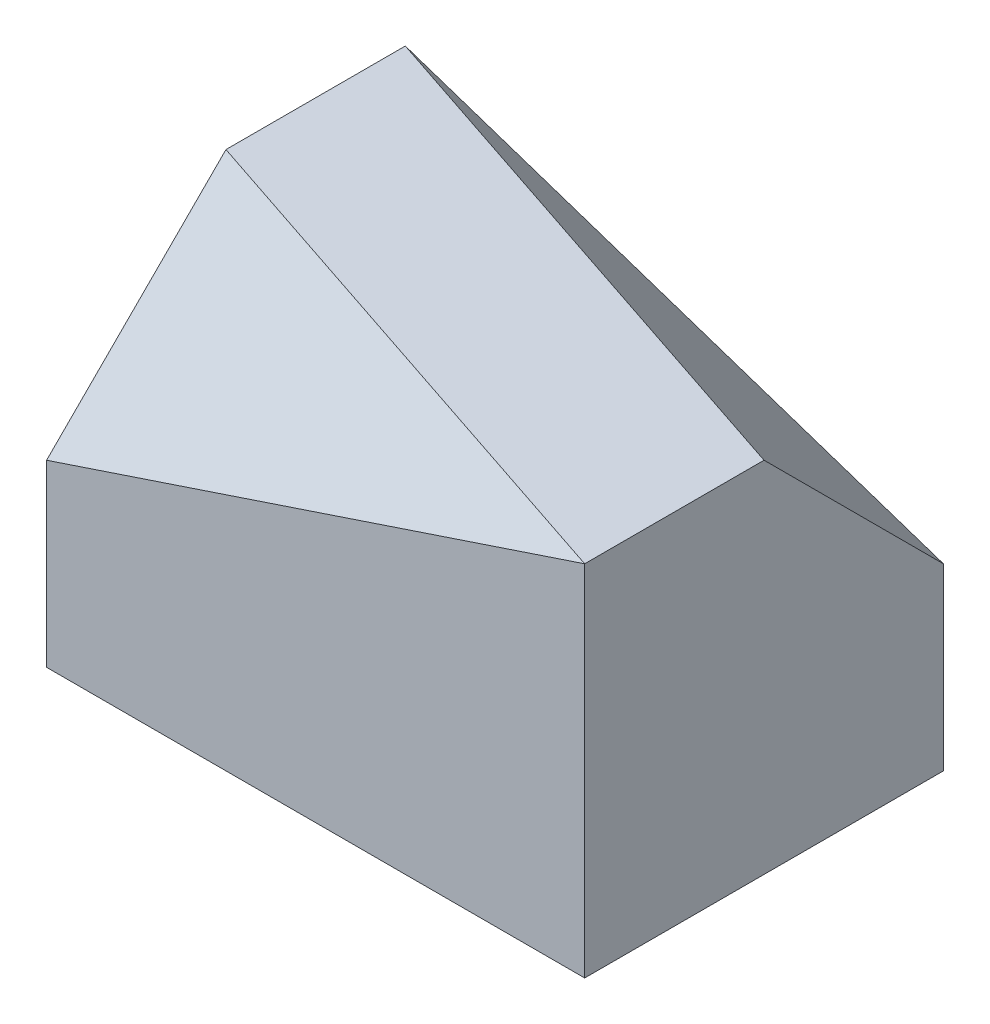
ISO-10303-21;
HEADER;
FILE_DESCRIPTION(('STEP AP214'),'2;1');
FILE_NAME('part.step','',(''),(''),'','','');
FILE_SCHEMA(('AUTOMOTIVE_DESIGN { 1 0 10303 214 1 1 1 1 }'));
ENDSEC;
DATA;
#1=APPLICATION_CONTEXT('core data for automotive mechanical design processes');
#2=APPLICATION_PROTOCOL_DEFINITION('international standard','automotive_design',2000,#1);
#3=PRODUCT_CONTEXT('',#1,'mechanical');
#4=PRODUCT('Part','Part','',(#3));
#5=PRODUCT_RELATED_PRODUCT_CATEGORY('part','',(#4));
#6=PRODUCT_DEFINITION_FORMATION('','',#4);
#7=PRODUCT_DEFINITION_CONTEXT('part definition',#1,'design');
#8=PRODUCT_DEFINITION('design','',#6,#7);
#9=PRODUCT_DEFINITION_SHAPE('','',#8);
#10=(LENGTH_UNIT() NAMED_UNIT(*) SI_UNIT(.MILLI.,.METRE.));
#11=(NAMED_UNIT(*) PLANE_ANGLE_UNIT() SI_UNIT($,.RADIAN.));
#12=(NAMED_UNIT(*) SI_UNIT($,.STERADIAN.) SOLID_ANGLE_UNIT());
#13=UNCERTAINTY_MEASURE_WITH_UNIT(LENGTH_MEASURE(1.E-05),#10,'distance_accuracy_value','');
#14=(GEOMETRIC_REPRESENTATION_CONTEXT(3) GLOBAL_UNCERTAINTY_ASSIGNED_CONTEXT((#13)) GLOBAL_UNIT_ASSIGNED_CONTEXT((#10,
#11,#12)) REPRESENTATION_CONTEXT('',''));
#15=CARTESIAN_POINT('',(0.,0.,0.));
#16=DIRECTION('',(0.,0.,1.));
#17=DIRECTION('',(1.,0.,0.));
#18=AXIS2_PLACEMENT_3D('',#15,#16,#17);
#19=CARTESIAN_POINT('',(-30.,40.,-20.));
#20=DIRECTION('',(1.,0.,0.));
#21=DIRECTION('',(0.,0.,-1.));
#22=AXIS2_PLACEMENT_3D('',#19,#20,#21);
#23=PLANE('',#22);
#24=DIRECTION('',(0.,-1.,0.));
#25=VECTOR('',#24,1.);
#26=CARTESIAN_POINT('',(-30.,40.,20.));
#27=LINE('',#26,#25);
#28=CARTESIAN_POINT('',(-30.,20.,20.));
#29=VERTEX_POINT('',#28);
#30=CARTESIAN_POINT('',(-30.,0.,20.));
#31=VERTEX_POINT('',#30);
#32=EDGE_CURVE('E101',#29,#31,#27,.T.);
#33=ORIENTED_EDGE('',*,*,#32,.F.);
#34=DIRECTION('',(0.,-0.707106781186548,0.707106781186548));
#35=VECTOR('',#34,1.);
#36=CARTESIAN_POINT('',(-30.,40.,0.));
#37=LINE('',#36,#35);
#38=CARTESIAN_POINT('',(-30.,40.,0.));
#39=VERTEX_POINT('',#38);
#40=EDGE_CURVE('E208',#39,#29,#37,.T.);
#41=ORIENTED_EDGE('',*,*,#40,.F.);
#42=DIRECTION('',(0.,0.,1.));
#43=VECTOR('',#42,1.);
#44=CARTESIAN_POINT('',(-30.,40.,-20.));
#45=LINE('',#44,#43);
#46=CARTESIAN_POINT('',(-30.,40.,-20.));
#47=VERTEX_POINT('',#46);
#48=EDGE_CURVE('E191',#47,#39,#45,.T.);
#49=ORIENTED_EDGE('',*,*,#48,.F.);
#50=DIRECTION('',(0.,-1.,0.));
#51=VECTOR('',#50,1.);
#52=CARTESIAN_POINT('',(-30.,40.,-20.));
#53=LINE('',#52,#51);
#54=CARTESIAN_POINT('',(-30.,0.,-20.));
#55=VERTEX_POINT('',#54);
#56=EDGE_CURVE('E186',#47,#55,#53,.T.);
#57=ORIENTED_EDGE('',*,*,#56,.T.);
#58=DIRECTION('',(0.,0.,1.));
#59=VECTOR('',#58,1.);
#60=CARTESIAN_POINT('',(-30.,0.,-20.));
#61=LINE('',#60,#59);
#62=EDGE_CURVE('E197',#55,#31,#61,.T.);
#63=ORIENTED_EDGE('',*,*,#62,.T.);
#64=EDGE_LOOP('',(#33,#41,#49,#57,#63));
#65=FACE_BOUND('',#64,.T.);
#66=ADVANCED_FACE('F147',(#65),#23,.F.);
#67=CARTESIAN_POINT('',(-30.,40.,20.));
#68=DIRECTION('',(0.,0.,-1.));
#69=DIRECTION('',(-1.,0.,0.));
#70=AXIS2_PLACEMENT_3D('',#67,#68,#69);
#71=PLANE('',#70);
#72=DIRECTION('',(0.,-1.,0.));
#73=VECTOR('',#72,1.);
#74=CARTESIAN_POINT('',(30.,40.,20.));
#75=LINE('',#74,#73);
#76=CARTESIAN_POINT('',(30.,40.,20.));
#77=VERTEX_POINT('',#76);
#78=CARTESIAN_POINT('',(30.,0.,20.));
#79=VERTEX_POINT('',#78);
#80=EDGE_CURVE('E155',#77,#79,#75,.T.);
#81=ORIENTED_EDGE('',*,*,#80,.F.);
#82=DIRECTION('',(0.948683298050514,0.316227766016838,0.));
#83=VECTOR('',#82,1.);
#84=CARTESIAN_POINT('',(-30.,20.,20.));
#85=LINE('',#84,#83);
#86=EDGE_CURVE('E205',#29,#77,#85,.T.);
#87=ORIENTED_EDGE('',*,*,#86,.F.);
#88=ORIENTED_EDGE('',*,*,#32,.T.);
#89=DIRECTION('',(1.,0.,0.));
#90=VECTOR('',#89,1.);
#91=CARTESIAN_POINT('',(-30.,0.,20.));
#92=LINE('',#91,#90);
#93=EDGE_CURVE('E204',#31,#79,#92,.T.);
#94=ORIENTED_EDGE('',*,*,#93,.T.);
#95=EDGE_LOOP('',(#81,#87,#88,#94));
#96=FACE_BOUND('',#95,.T.);
#97=ADVANCED_FACE('F223',(#96),#71,.F.);
#98=CARTESIAN_POINT('',(30.,40.,-20.));
#99=DIRECTION('',(-1.,0.,0.));
#100=DIRECTION('',(0.,0.,1.));
#101=AXIS2_PLACEMENT_3D('',#98,#99,#100);
#102=PLANE('',#101);
#103=DIRECTION('',(0.,-1.,0.));
#104=VECTOR('',#103,1.);
#105=CARTESIAN_POINT('',(30.,40.,-20.));
#106=LINE('',#105,#104);
#107=CARTESIAN_POINT('',(30.,20.,-20.));
#108=VERTEX_POINT('',#107);
#109=CARTESIAN_POINT('',(30.,0.,-20.));
#110=VERTEX_POINT('',#109);
#111=EDGE_CURVE('E179',#108,#110,#106,.T.);
#112=ORIENTED_EDGE('',*,*,#111,.F.);
#113=DIRECTION('',(0.,-0.707106781186548,-0.707106781186548));
#114=VECTOR('',#113,1.);
#115=CARTESIAN_POINT('',(30.,40.,0.));
#116=LINE('',#115,#114);
#117=CARTESIAN_POINT('',(30.,40.,0.));
#118=VERTEX_POINT('',#117);
#119=EDGE_CURVE('E235',#118,#108,#116,.T.);
#120=ORIENTED_EDGE('',*,*,#119,.F.);
#121=DIRECTION('',(0.,0.,-1.));
#122=VECTOR('',#121,1.);
#123=CARTESIAN_POINT('',(30.,40.,-20.));
#124=LINE('',#123,#122);
#125=EDGE_CURVE('E200',#77,#118,#124,.T.);
#126=ORIENTED_EDGE('',*,*,#125,.F.);
#127=ORIENTED_EDGE('',*,*,#80,.T.);
#128=DIRECTION('',(0.,0.,-1.));
#129=VECTOR('',#128,1.);
#130=CARTESIAN_POINT('',(30.,0.,-20.));
#131=LINE('',#130,#129);
#132=EDGE_CURVE('E192',#79,#110,#131,.T.);
#133=ORIENTED_EDGE('',*,*,#132,.T.);
#134=EDGE_LOOP('',(#112,#120,#126,#127,#133));
#135=FACE_BOUND('',#134,.T.);
#136=ADVANCED_FACE('F218',(#135),#102,.F.);
#137=CARTESIAN_POINT('',(-30.,40.,-20.));
#138=DIRECTION('',(0.,0.,1.));
#139=DIRECTION('',(1.,0.,0.));
#140=AXIS2_PLACEMENT_3D('',#137,#138,#139);
#141=PLANE('',#140);
#142=ORIENTED_EDGE('',*,*,#56,.F.);
#143=DIRECTION('',(-0.948683298050514,0.316227766016838,0.));
#144=VECTOR('',#143,1.);
#145=CARTESIAN_POINT('',(30.,20.,-20.));
#146=LINE('',#145,#144);
#147=EDGE_CURVE('E163',#108,#47,#146,.T.);
#148=ORIENTED_EDGE('',*,*,#147,.F.);
#149=ORIENTED_EDGE('',*,*,#111,.T.);
#150=DIRECTION('',(-1.,0.,0.));
#151=VECTOR('',#150,1.);
#152=CARTESIAN_POINT('',(-30.,0.,-20.));
#153=LINE('',#152,#151);
#154=EDGE_CURVE('E183',#110,#55,#153,.T.);
#155=ORIENTED_EDGE('',*,*,#154,.T.);
#156=EDGE_LOOP('',(#142,#148,#149,#155));
#157=FACE_BOUND('',#156,.T.);
#158=ADVANCED_FACE('F185',(#157),#141,.F.);
#159=CARTESIAN_POINT('',(0.,40.,0.));
#160=DIRECTION('',(0.,1.,0.));
#161=DIRECTION('',(0.,0.,1.));
#162=AXIS2_PLACEMENT_3D('',#159,#160,#161);
#163=PLANE('',#162);
#164=DIRECTION('',(0.948683298050514,0.,0.316227766016838));
#165=VECTOR('',#164,1.);
#166=CARTESIAN_POINT('',(-30.,40.,-20.));
#167=LINE('',#166,#165);
#168=EDGE_CURVE('E233',#47,#118,#167,.T.);
#169=ORIENTED_EDGE('',*,*,#168,.F.);
#170=ORIENTED_EDGE('',*,*,#48,.T.);
#171=DIRECTION('',(0.948683298050514,0.,0.316227766016838));
#172=VECTOR('',#171,1.);
#173=CARTESIAN_POINT('',(-3.,40.,9.00000000000002));
#174=LINE('',#173,#172);
#175=EDGE_CURVE('E241',#39,#77,#174,.T.);
#176=ORIENTED_EDGE('',*,*,#175,.T.);
#177=ORIENTED_EDGE('',*,*,#125,.T.);
#178=EDGE_LOOP('',(#169,#170,#176,#177));
#179=FACE_BOUND('',#178,.T.);
#180=ADVANCED_FACE('F240',(#179),#163,.T.);
#181=CARTESIAN_POINT('',(0.,0.,0.));
#182=DIRECTION('',(0.,1.,0.));
#183=DIRECTION('',(0.,0.,1.));
#184=AXIS2_PLACEMENT_3D('',#181,#182,#183);
#185=PLANE('',#184);
#186=ORIENTED_EDGE('',*,*,#62,.F.);
#187=ORIENTED_EDGE('',*,*,#154,.F.);
#188=ORIENTED_EDGE('',*,*,#132,.F.);
#189=ORIENTED_EDGE('',*,*,#93,.F.);
#190=EDGE_LOOP('',(#186,#187,#188,#189));
#191=FACE_BOUND('',#190,.T.);
#192=ADVANCED_FACE('F203',(#191),#185,.F.);
#193=CARTESIAN_POINT('',(-30.,40.,0.));
#194=DIRECTION('',(0.229415733870562,-0.688247201611685,-0.688247201611685));
#195=DIRECTION('',(0.,0.707106781186548,-0.707106781186548));
#196=AXIS2_PLACEMENT_3D('',#193,#194,#195);
#197=PLANE('',#196);
#198=ORIENTED_EDGE('',*,*,#40,.T.);
#199=ORIENTED_EDGE('',*,*,#86,.T.);
#200=ORIENTED_EDGE('',*,*,#175,.F.);
#201=EDGE_LOOP('',(#198,#199,#200));
#202=FACE_BOUND('',#201,.T.);
#203=ADVANCED_FACE('F245',(#202),#197,.F.);
#204=CARTESIAN_POINT('',(30.,40.,0.));
#205=DIRECTION('',(-0.229415733870562,-0.688247201611685,0.688247201611685));
#206=DIRECTION('',(0.,-0.707106781186548,-0.707106781186548));
#207=AXIS2_PLACEMENT_3D('',#204,#205,#206);
#208=PLANE('',#207);
#209=ORIENTED_EDGE('',*,*,#119,.T.);
#210=ORIENTED_EDGE('',*,*,#147,.T.);
#211=ORIENTED_EDGE('',*,*,#168,.T.);
#212=EDGE_LOOP('',(#209,#210,#211));
#213=FACE_BOUND('',#212,.T.);
#214=ADVANCED_FACE('F234',(#213),#208,.F.);
#215=CLOSED_SHELL('',(#66,#97,#136,#158,#180,#192,#203,#214));
#216=MANIFOLD_SOLID_BREP('B42',#215);
#217=ADVANCED_BREP_SHAPE_REPRESENTATION('',(#18,#216),#14);
#218=SHAPE_DEFINITION_REPRESENTATION(#9,#217);
ENDSEC;
END-ISO-10303-21;
